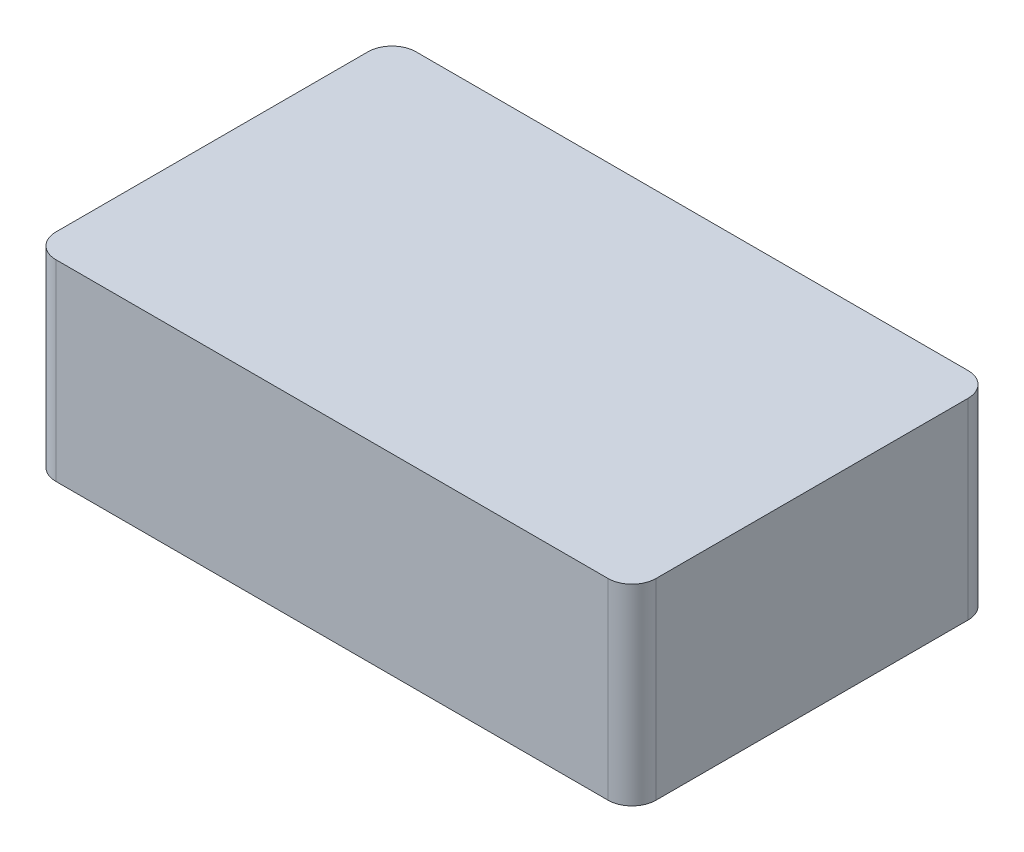
ISO-10303-21;
HEADER;
FILE_DESCRIPTION(('STEP AP214'),'2;1');
FILE_NAME('part.step','',(''),(''),'','','');
FILE_SCHEMA(('AUTOMOTIVE_DESIGN { 1 0 10303 214 1 1 1 1 }'));
ENDSEC;
DATA;
#1=APPLICATION_CONTEXT('core data for automotive mechanical design processes');
#2=APPLICATION_PROTOCOL_DEFINITION('international standard','automotive_design',2000,#1);
#3=PRODUCT_CONTEXT('',#1,'mechanical');
#4=PRODUCT('Part','Part','',(#3));
#5=PRODUCT_RELATED_PRODUCT_CATEGORY('part','',(#4));
#6=PRODUCT_DEFINITION_FORMATION('','',#4);
#7=PRODUCT_DEFINITION_CONTEXT('part definition',#1,'design');
#8=PRODUCT_DEFINITION('design','',#6,#7);
#9=PRODUCT_DEFINITION_SHAPE('','',#8);
#10=(LENGTH_UNIT() NAMED_UNIT(*) SI_UNIT(.MILLI.,.METRE.));
#11=(NAMED_UNIT(*) PLANE_ANGLE_UNIT() SI_UNIT($,.RADIAN.));
#12=(NAMED_UNIT(*) SI_UNIT($,.STERADIAN.) SOLID_ANGLE_UNIT());
#13=UNCERTAINTY_MEASURE_WITH_UNIT(LENGTH_MEASURE(1.E-05),#10,'distance_accuracy_value','');
#14=(GEOMETRIC_REPRESENTATION_CONTEXT(3) GLOBAL_UNCERTAINTY_ASSIGNED_CONTEXT((#13)) GLOBAL_UNIT_ASSIGNED_CONTEXT((#10,
#11,#12)) REPRESENTATION_CONTEXT('',''));
#15=CARTESIAN_POINT('',(0.,0.,0.));
#16=DIRECTION('',(0.,0.,1.));
#17=DIRECTION('',(1.,0.,0.));
#18=AXIS2_PLACEMENT_3D('',#15,#16,#17);
#19=CARTESIAN_POINT('',(100.,80.,-80.4022952249925));
#20=DIRECTION('',(0.,-1.,0.));
#21=DIRECTION('',(0.,0.,-1.));
#22=AXIS2_PLACEMENT_3D('',#19,#20,#21);
#23=CYLINDRICAL_SURFACE('',#22,9.99999999999999);
#24=CARTESIAN_POINT('',(100.,0.,-80.4022952249925));
#25=DIRECTION('',(0.,1.,0.));
#26=DIRECTION('',(0.,0.,-1.));
#27=AXIS2_PLACEMENT_3D('',#24,#25,#26);
#28=CIRCLE('',#27,9.99999999999999);
#29=CARTESIAN_POINT('',(110.,0.,-80.4022952249924));
#30=VERTEX_POINT('',#29);
#31=CARTESIAN_POINT('',(99.9999999999999,0.,-90.4022952249924));
#32=VERTEX_POINT('',#31);
#33=EDGE_CURVE('E140',#30,#32,#28,.T.);
#34=ORIENTED_EDGE('',*,*,#33,.T.);
#35=DIRECTION('',(0.,-1.,0.));
#36=VECTOR('',#35,1.);
#37=CARTESIAN_POINT('',(99.9999999999999,80.,-90.4022952249924));
#38=LINE('',#37,#36);
#39=CARTESIAN_POINT('',(99.9999999999999,80.,-90.4022952249924));
#40=VERTEX_POINT('',#39);
#41=EDGE_CURVE('E11',#40,#32,#38,.T.);
#42=ORIENTED_EDGE('',*,*,#41,.F.);
#43=CARTESIAN_POINT('',(100.,80.,-80.4022952249925));
#44=DIRECTION('',(0.,1.,0.));
#45=DIRECTION('',(0.,0.,-1.));
#46=AXIS2_PLACEMENT_3D('',#43,#44,#45);
#47=CIRCLE('',#46,9.99999999999999);
#48=CARTESIAN_POINT('',(110.,80.,-80.4022952249924));
#49=VERTEX_POINT('',#48);
#50=EDGE_CURVE('E162',#49,#40,#47,.T.);
#51=ORIENTED_EDGE('',*,*,#50,.F.);
#52=DIRECTION('',(0.,-1.,0.));
#53=VECTOR('',#52,1.);
#54=CARTESIAN_POINT('',(110.,80.,-80.4022952249924));
#55=LINE('',#54,#53);
#56=EDGE_CURVE('E136',#49,#30,#55,.T.);
#57=ORIENTED_EDGE('',*,*,#56,.T.);
#58=EDGE_LOOP('',(#34,#42,#51,#57));
#59=FACE_BOUND('',#58,.T.);
#60=ADVANCED_FACE('F39',(#59),#23,.T.);
#61=CARTESIAN_POINT('',(99.9999999999999,80.,-90.4022952249924));
#62=DIRECTION('',(0.,0.,1.));
#63=DIRECTION('',(1.,0.,0.));
#64=AXIS2_PLACEMENT_3D('',#61,#62,#63);
#65=PLANE('',#64);
#66=DIRECTION('',(-1.,0.,0.));
#67=VECTOR('',#66,1.);
#68=CARTESIAN_POINT('',(99.9999999999999,0.,-90.4022952249924));
#69=LINE('',#68,#67);
#70=CARTESIAN_POINT('',(-130.,0.,-90.4022952249924));
#71=VERTEX_POINT('',#70);
#72=EDGE_CURVE('E144',#32,#71,#69,.T.);
#73=ORIENTED_EDGE('',*,*,#72,.T.);
#74=DIRECTION('',(0.,-1.,0.));
#75=VECTOR('',#74,1.);
#76=CARTESIAN_POINT('',(-130.,80.,-90.4022952249924));
#77=LINE('',#76,#75);
#78=CARTESIAN_POINT('',(-130.,80.,-90.4022952249924));
#79=VERTEX_POINT('',#78);
#80=EDGE_CURVE('E48',#79,#71,#77,.T.);
#81=ORIENTED_EDGE('',*,*,#80,.F.);
#82=DIRECTION('',(-1.,0.,0.));
#83=VECTOR('',#82,1.);
#84=CARTESIAN_POINT('',(99.9999999999999,80.,-90.4022952249924));
#85=LINE('',#84,#83);
#86=EDGE_CURVE('E99',#40,#79,#85,.T.);
#87=ORIENTED_EDGE('',*,*,#86,.F.);
#88=ORIENTED_EDGE('',*,*,#41,.T.);
#89=EDGE_LOOP('',(#73,#81,#87,#88));
#90=FACE_BOUND('',#89,.T.);
#91=ADVANCED_FACE('F208',(#90),#65,.F.);
#92=CARTESIAN_POINT('',(-130.,80.,-80.4022952249924));
#93=DIRECTION('',(0.,-1.,0.));
#94=DIRECTION('',(0.,0.,-1.));
#95=AXIS2_PLACEMENT_3D('',#92,#93,#94);
#96=CYLINDRICAL_SURFACE('',#95,10.);
#97=CARTESIAN_POINT('',(-130.,0.,-80.4022952249924));
#98=DIRECTION('',(0.,1.,0.));
#99=DIRECTION('',(0.,0.,1.));
#100=AXIS2_PLACEMENT_3D('',#97,#98,#99);
#101=CIRCLE('',#100,10.);
#102=CARTESIAN_POINT('',(-140.,0.,-80.4022952249923));
#103=VERTEX_POINT('',#102);
#104=EDGE_CURVE('E147',#71,#103,#101,.T.);
#105=ORIENTED_EDGE('',*,*,#104,.T.);
#106=DIRECTION('',(0.,-1.,0.));
#107=VECTOR('',#106,1.);
#108=CARTESIAN_POINT('',(-140.,80.,-80.4022952249923));
#109=LINE('',#108,#107);
#110=CARTESIAN_POINT('',(-140.,80.,-80.4022952249923));
#111=VERTEX_POINT('',#110);
#112=EDGE_CURVE('E173',#111,#103,#109,.T.);
#113=ORIENTED_EDGE('',*,*,#112,.F.);
#114=CARTESIAN_POINT('',(-130.,80.,-80.4022952249924));
#115=DIRECTION('',(0.,1.,0.));
#116=DIRECTION('',(0.,0.,1.));
#117=AXIS2_PLACEMENT_3D('',#114,#115,#116);
#118=CIRCLE('',#117,10.);
#119=EDGE_CURVE('E183',#79,#111,#118,.T.);
#120=ORIENTED_EDGE('',*,*,#119,.F.);
#121=ORIENTED_EDGE('',*,*,#80,.T.);
#122=EDGE_LOOP('',(#105,#113,#120,#121));
#123=FACE_BOUND('',#122,.T.);
#124=ADVANCED_FACE('F181',(#123),#96,.T.);
#125=CARTESIAN_POINT('',(-140.,80.,-80.4022952249923));
#126=DIRECTION('',(1.,0.,0.));
#127=DIRECTION('',(0.,0.,-1.));
#128=AXIS2_PLACEMENT_3D('',#125,#126,#127);
#129=PLANE('',#128);
#130=DIRECTION('',(0.,0.,1.));
#131=VECTOR('',#130,1.);
#132=CARTESIAN_POINT('',(-140.,0.,-80.4022952249923));
#133=LINE('',#132,#131);
#134=CARTESIAN_POINT('',(-140.,0.,49.5977047750075));
#135=VERTEX_POINT('',#134);
#136=EDGE_CURVE('E150',#103,#135,#133,.T.);
#137=ORIENTED_EDGE('',*,*,#136,.T.);
#138=DIRECTION('',(0.,-1.,0.));
#139=VECTOR('',#138,1.);
#140=CARTESIAN_POINT('',(-140.,80.,49.5977047750075));
#141=LINE('',#140,#139);
#142=CARTESIAN_POINT('',(-140.,80.,49.5977047750075));
#143=VERTEX_POINT('',#142);
#144=EDGE_CURVE('E169',#143,#135,#141,.T.);
#145=ORIENTED_EDGE('',*,*,#144,.F.);
#146=DIRECTION('',(0.,0.,1.));
#147=VECTOR('',#146,1.);
#148=CARTESIAN_POINT('',(-140.,80.,-80.4022952249923));
#149=LINE('',#148,#147);
#150=EDGE_CURVE('E196',#111,#143,#149,.T.);
#151=ORIENTED_EDGE('',*,*,#150,.F.);
#152=ORIENTED_EDGE('',*,*,#112,.T.);
#153=EDGE_LOOP('',(#137,#145,#151,#152));
#154=FACE_BOUND('',#153,.T.);
#155=ADVANCED_FACE('F191',(#154),#129,.F.);
#156=CARTESIAN_POINT('',(-130.,80.,49.5977047750076));
#157=DIRECTION('',(0.,-1.,0.));
#158=DIRECTION('',(0.,0.,-1.));
#159=AXIS2_PLACEMENT_3D('',#156,#157,#158);
#160=CYLINDRICAL_SURFACE('',#159,10.);
#161=CARTESIAN_POINT('',(-130.,0.,49.5977047750076));
#162=DIRECTION('',(0.,1.,0.));
#163=DIRECTION('',(0.,0.,-1.));
#164=AXIS2_PLACEMENT_3D('',#161,#162,#163);
#165=CIRCLE('',#164,10.);
#166=CARTESIAN_POINT('',(-130.,0.,59.5977047750076));
#167=VERTEX_POINT('',#166);
#168=EDGE_CURVE('E153',#135,#167,#165,.T.);
#169=ORIENTED_EDGE('',*,*,#168,.T.);
#170=DIRECTION('',(0.,-1.,0.));
#171=VECTOR('',#170,1.);
#172=CARTESIAN_POINT('',(-130.,80.,59.5977047750076));
#173=LINE('',#172,#171);
#174=CARTESIAN_POINT('',(-130.,80.,59.5977047750076));
#175=VERTEX_POINT('',#174);
#176=EDGE_CURVE('E129',#175,#167,#173,.T.);
#177=ORIENTED_EDGE('',*,*,#176,.F.);
#178=CARTESIAN_POINT('',(-130.,80.,49.5977047750076));
#179=DIRECTION('',(0.,1.,0.));
#180=DIRECTION('',(0.,0.,-1.));
#181=AXIS2_PLACEMENT_3D('',#178,#179,#180);
#182=CIRCLE('',#181,10.);
#183=EDGE_CURVE('E118',#143,#175,#182,.T.);
#184=ORIENTED_EDGE('',*,*,#183,.F.);
#185=ORIENTED_EDGE('',*,*,#144,.T.);
#186=EDGE_LOOP('',(#169,#177,#184,#185));
#187=FACE_BOUND('',#186,.T.);
#188=ADVANCED_FACE('F194',(#187),#160,.T.);
#189=CARTESIAN_POINT('',(99.9999999999999,80.,59.5977047750075));
#190=DIRECTION('',(0.,0.,-1.));
#191=DIRECTION('',(-1.,0.,0.));
#192=AXIS2_PLACEMENT_3D('',#189,#190,#191);
#193=PLANE('',#192);
#194=DIRECTION('',(1.,0.,0.));
#195=VECTOR('',#194,1.);
#196=CARTESIAN_POINT('',(99.9999999999999,0.,59.5977047750075));
#197=LINE('',#196,#195);
#198=CARTESIAN_POINT('',(99.9999999999999,0.,59.5977047750075));
#199=VERTEX_POINT('',#198);
#200=EDGE_CURVE('E127',#167,#199,#197,.T.);
#201=ORIENTED_EDGE('',*,*,#200,.T.);
#202=DIRECTION('',(0.,-1.,0.));
#203=VECTOR('',#202,1.);
#204=CARTESIAN_POINT('',(99.9999999999999,80.,59.5977047750075));
#205=LINE('',#204,#203);
#206=CARTESIAN_POINT('',(99.9999999999999,80.,59.5977047750075));
#207=VERTEX_POINT('',#206);
#208=EDGE_CURVE('E124',#207,#199,#205,.T.);
#209=ORIENTED_EDGE('',*,*,#208,.F.);
#210=DIRECTION('',(1.,0.,0.));
#211=VECTOR('',#210,1.);
#212=CARTESIAN_POINT('',(99.9999999999999,80.,59.5977047750075));
#213=LINE('',#212,#211);
#214=EDGE_CURVE('E112',#175,#207,#213,.T.);
#215=ORIENTED_EDGE('',*,*,#214,.F.);
#216=ORIENTED_EDGE('',*,*,#176,.T.);
#217=EDGE_LOOP('',(#201,#209,#215,#216));
#218=FACE_BOUND('',#217,.T.);
#219=ADVANCED_FACE('F125',(#218),#193,.F.);
#220=CARTESIAN_POINT('',(100.,80.,49.5977047750075));
#221=DIRECTION('',(0.,-1.,0.));
#222=DIRECTION('',(0.,0.,-1.));
#223=AXIS2_PLACEMENT_3D('',#220,#221,#222);
#224=CYLINDRICAL_SURFACE('',#223,9.99999999999999);
#225=CARTESIAN_POINT('',(100.,0.,49.5977047750075));
#226=DIRECTION('',(0.,1.,0.));
#227=DIRECTION('',(0.,0.,-1.));
#228=AXIS2_PLACEMENT_3D('',#225,#226,#227);
#229=CIRCLE('',#228,9.99999999999999);
#230=CARTESIAN_POINT('',(110.,0.,49.5977047750075));
#231=VERTEX_POINT('',#230);
#232=EDGE_CURVE('E85',#199,#231,#229,.T.);
#233=ORIENTED_EDGE('',*,*,#232,.T.);
#234=DIRECTION('',(0.,-1.,0.));
#235=VECTOR('',#234,1.);
#236=CARTESIAN_POINT('',(110.,80.,49.5977047750075));
#237=LINE('',#236,#235);
#238=CARTESIAN_POINT('',(110.,80.,49.5977047750075));
#239=VERTEX_POINT('',#238);
#240=EDGE_CURVE('E130',#239,#231,#237,.T.);
#241=ORIENTED_EDGE('',*,*,#240,.F.);
#242=CARTESIAN_POINT('',(100.,80.,49.5977047750075));
#243=DIRECTION('',(0.,1.,0.));
#244=DIRECTION('',(0.,0.,-1.));
#245=AXIS2_PLACEMENT_3D('',#242,#243,#244);
#246=CIRCLE('',#245,9.99999999999999);
#247=EDGE_CURVE('E116',#207,#239,#246,.T.);
#248=ORIENTED_EDGE('',*,*,#247,.F.);
#249=ORIENTED_EDGE('',*,*,#208,.T.);
#250=EDGE_LOOP('',(#233,#241,#248,#249));
#251=FACE_BOUND('',#250,.T.);
#252=ADVANCED_FACE('F132',(#251),#224,.T.);
#253=CARTESIAN_POINT('',(110.,80.,-80.4022952249924));
#254=DIRECTION('',(-1.,0.,0.));
#255=DIRECTION('',(0.,0.,1.));
#256=AXIS2_PLACEMENT_3D('',#253,#254,#255);
#257=PLANE('',#256);
#258=DIRECTION('',(0.,0.,-1.));
#259=VECTOR('',#258,1.);
#260=CARTESIAN_POINT('',(110.,0.,-80.4022952249924));
#261=LINE('',#260,#259);
#262=EDGE_CURVE('E91',#231,#30,#261,.T.);
#263=ORIENTED_EDGE('',*,*,#262,.T.);
#264=ORIENTED_EDGE('',*,*,#56,.F.);
#265=DIRECTION('',(0.,0.,-1.));
#266=VECTOR('',#265,1.);
#267=CARTESIAN_POINT('',(110.,80.,-80.4022952249924));
#268=LINE('',#267,#266);
#269=EDGE_CURVE('E56',#239,#49,#268,.T.);
#270=ORIENTED_EDGE('',*,*,#269,.F.);
#271=ORIENTED_EDGE('',*,*,#240,.T.);
#272=EDGE_LOOP('',(#263,#264,#270,#271));
#273=FACE_BOUND('',#272,.T.);
#274=ADVANCED_FACE('F224',(#273),#257,.F.);
#275=CARTESIAN_POINT('',(100.,80.,-80.4022952249925));
#276=DIRECTION('',(0.,-1.,0.));
#277=DIRECTION('',(0.,0.,-1.));
#278=AXIS2_PLACEMENT_3D('',#275,#276,#277);
#279=PLANE('',#278);
#280=ORIENTED_EDGE('',*,*,#50,.T.);
#281=ORIENTED_EDGE('',*,*,#86,.T.);
#282=ORIENTED_EDGE('',*,*,#119,.T.);
#283=ORIENTED_EDGE('',*,*,#150,.T.);
#284=ORIENTED_EDGE('',*,*,#183,.T.);
#285=ORIENTED_EDGE('',*,*,#214,.T.);
#286=ORIENTED_EDGE('',*,*,#247,.T.);
#287=ORIENTED_EDGE('',*,*,#269,.T.);
#288=EDGE_LOOP('',(#280,#281,#282,#283,#284,#285,#286,#287));
#289=FACE_BOUND('',#288,.T.);
#290=ADVANCED_FACE('F114',(#289),#279,.F.);
#291=CARTESIAN_POINT('',(100.,0.,-80.4022952249925));
#292=DIRECTION('',(0.,-1.,0.));
#293=DIRECTION('',(0.,0.,-1.));
#294=AXIS2_PLACEMENT_3D('',#291,#292,#293);
#295=PLANE('',#294);
#296=ORIENTED_EDGE('',*,*,#33,.F.);
#297=ORIENTED_EDGE('',*,*,#262,.F.);
#298=ORIENTED_EDGE('',*,*,#232,.F.);
#299=ORIENTED_EDGE('',*,*,#200,.F.);
#300=ORIENTED_EDGE('',*,*,#168,.F.);
#301=ORIENTED_EDGE('',*,*,#136,.F.);
#302=ORIENTED_EDGE('',*,*,#104,.F.);
#303=ORIENTED_EDGE('',*,*,#72,.F.);
#304=EDGE_LOOP('',(#296,#297,#298,#299,#300,#301,#302,#303));
#305=FACE_BOUND('',#304,.T.);
#306=ADVANCED_FACE('F187',(#305),#295,.T.);
#307=CLOSED_SHELL('',(#60,#91,#124,#155,#188,#219,#252,#274,#290,#306));
#308=MANIFOLD_SOLID_BREP('B2',#307);
#309=ADVANCED_BREP_SHAPE_REPRESENTATION('',(#18,#308),#14);
#310=SHAPE_DEFINITION_REPRESENTATION(#9,#309);
ENDSEC;
END-ISO-10303-21;
